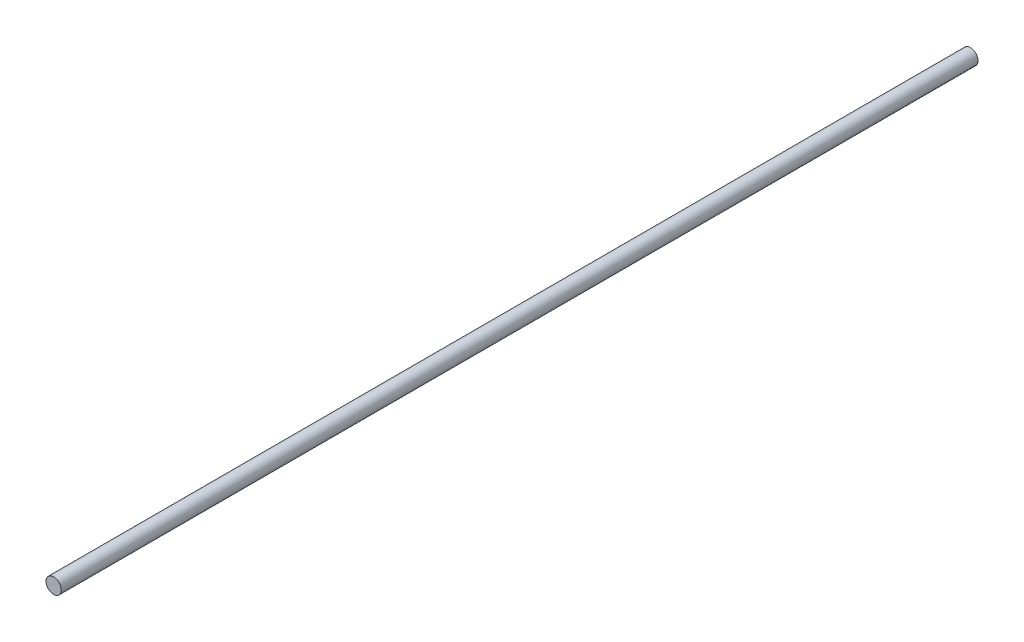
ISO-10303-21;
HEADER;
FILE_DESCRIPTION(('STEP AP214'),'2;1');
FILE_NAME('part.step','',(''),(''),'','','');
FILE_SCHEMA(('AUTOMOTIVE_DESIGN { 1 0 10303 214 1 1 1 1 }'));
ENDSEC;
DATA;
#1=APPLICATION_CONTEXT('core data for automotive mechanical design processes');
#2=APPLICATION_PROTOCOL_DEFINITION('international standard','automotive_design',2000,#1);
#3=PRODUCT_CONTEXT('',#1,'mechanical');
#4=PRODUCT('Part','Part','',(#3));
#5=PRODUCT_RELATED_PRODUCT_CATEGORY('part','',(#4));
#6=PRODUCT_DEFINITION_FORMATION('','',#4);
#7=PRODUCT_DEFINITION_CONTEXT('part definition',#1,'design');
#8=PRODUCT_DEFINITION('design','',#6,#7);
#9=PRODUCT_DEFINITION_SHAPE('','',#8);
#10=(LENGTH_UNIT() NAMED_UNIT(*) SI_UNIT(.MILLI.,.METRE.));
#11=(NAMED_UNIT(*) PLANE_ANGLE_UNIT() SI_UNIT($,.RADIAN.));
#12=(NAMED_UNIT(*) SI_UNIT($,.STERADIAN.) SOLID_ANGLE_UNIT());
#13=UNCERTAINTY_MEASURE_WITH_UNIT(LENGTH_MEASURE(1.E-05),#10,'distance_accuracy_value','');
#14=(GEOMETRIC_REPRESENTATION_CONTEXT(3) GLOBAL_UNCERTAINTY_ASSIGNED_CONTEXT((#13)) GLOBAL_UNIT_ASSIGNED_CONTEXT((#10,
#11,#12)) REPRESENTATION_CONTEXT('',''));
#15=CARTESIAN_POINT('',(0.,0.,0.));
#16=DIRECTION('',(0.,0.,1.));
#17=DIRECTION('',(1.,0.,0.));
#18=AXIS2_PLACEMENT_3D('',#15,#16,#17);
#19=CARTESIAN_POINT('',(0.,0.,480.));
#20=DIRECTION('',(0.,0.,-1.));
#21=DIRECTION('',(-1.,0.,0.));
#22=AXIS2_PLACEMENT_3D('',#19,#20,#21);
#23=CYLINDRICAL_SURFACE('',#22,4.);
#24=CARTESIAN_POINT('',(0.,0.,480.));
#25=DIRECTION('',(0.,0.,1.));
#26=DIRECTION('',(1.,0.,0.));
#27=AXIS2_PLACEMENT_3D('',#24,#25,#26);
#28=CIRCLE('',#27,4.);
#29=CARTESIAN_POINT('',(4.,0.,480.));
#30=VERTEX_POINT('',#29);
#31=EDGE_CURVE('E10',#30,#30,#28,.T.);
#32=ORIENTED_EDGE('',*,*,#31,.F.);
#33=EDGE_LOOP('',(#32));
#34=FACE_BOUND('',#33,.T.);
#35=CARTESIAN_POINT('',(0.,0.,0.));
#36=DIRECTION('',(0.,0.,1.));
#37=DIRECTION('',(1.,0.,0.));
#38=AXIS2_PLACEMENT_3D('',#35,#36,#37);
#39=CIRCLE('',#38,4.);
#40=CARTESIAN_POINT('',(4.,0.,0.));
#41=VERTEX_POINT('',#40);
#42=EDGE_CURVE('E34',#41,#41,#39,.T.);
#43=ORIENTED_EDGE('',*,*,#42,.T.);
#44=EDGE_LOOP('',(#43));
#45=FACE_BOUND('',#44,.T.);
#46=ADVANCED_FACE('F31',(#34,#45),#23,.T.);
#47=CARTESIAN_POINT('',(0.,0.,480.));
#48=DIRECTION('',(0.,0.,1.));
#49=DIRECTION('',(1.,0.,0.));
#50=AXIS2_PLACEMENT_3D('',#47,#48,#49);
#51=PLANE('',#50);
#52=ORIENTED_EDGE('',*,*,#31,.T.);
#53=EDGE_LOOP('',(#52));
#54=FACE_BOUND('',#53,.T.);
#55=ADVANCED_FACE('F46',(#54),#51,.T.);
#56=CARTESIAN_POINT('',(0.,0.,0.));
#57=DIRECTION('',(0.,0.,1.));
#58=DIRECTION('',(1.,0.,0.));
#59=AXIS2_PLACEMENT_3D('',#56,#57,#58);
#60=PLANE('',#59);
#61=ORIENTED_EDGE('',*,*,#42,.F.);
#62=EDGE_LOOP('',(#61));
#63=FACE_BOUND('',#62,.T.);
#64=ADVANCED_FACE('F44',(#63),#60,.F.);
#65=CLOSED_SHELL('',(#46,#55,#64));
#66=MANIFOLD_SOLID_BREP('B2',#65);
#67=ADVANCED_BREP_SHAPE_REPRESENTATION('',(#18,#66),#14);
#68=SHAPE_DEFINITION_REPRESENTATION(#9,#67);
ENDSEC;
END-ISO-10303-21;
